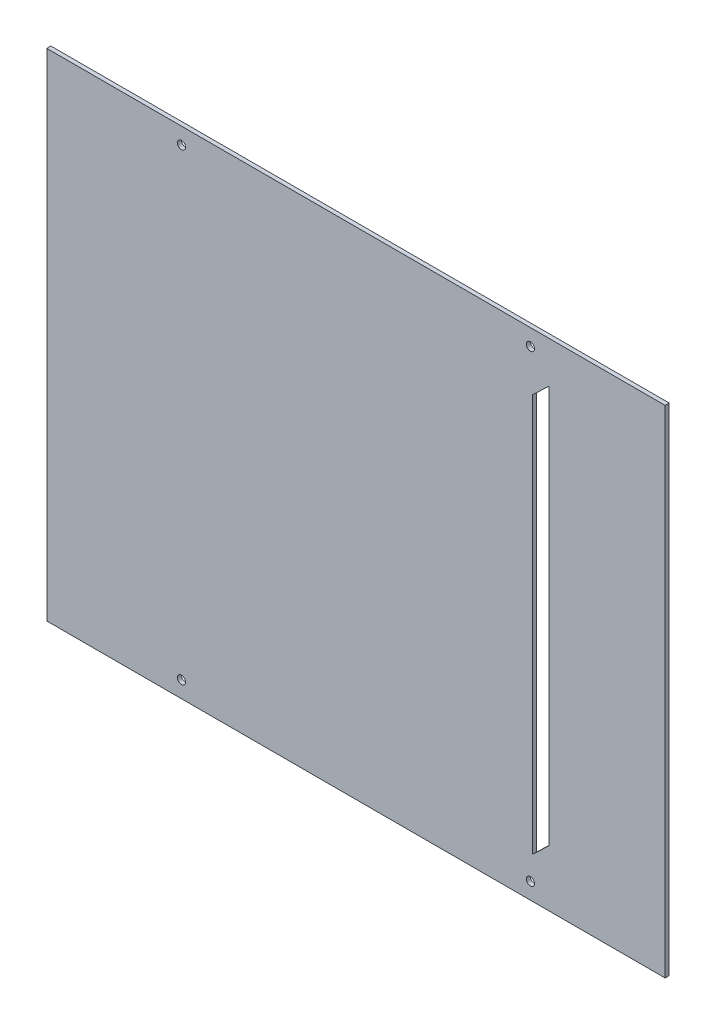
ISO-10303-21;
HEADER;
FILE_DESCRIPTION(('STEP AP214'),'2;1');
FILE_NAME('part.step','',(''),(''),'','','');
FILE_SCHEMA(('AUTOMOTIVE_DESIGN { 1 0 10303 214 1 1 1 1 }'));
ENDSEC;
DATA;
#1=APPLICATION_CONTEXT('core data for automotive mechanical design processes');
#2=APPLICATION_PROTOCOL_DEFINITION('international standard','automotive_design',2000,#1);
#3=PRODUCT_CONTEXT('',#1,'mechanical');
#4=PRODUCT('Part','Part','',(#3));
#5=PRODUCT_RELATED_PRODUCT_CATEGORY('part','',(#4));
#6=PRODUCT_DEFINITION_FORMATION('','',#4);
#7=PRODUCT_DEFINITION_CONTEXT('part definition',#1,'design');
#8=PRODUCT_DEFINITION('design','',#6,#7);
#9=PRODUCT_DEFINITION_SHAPE('','',#8);
#10=(LENGTH_UNIT() NAMED_UNIT(*) SI_UNIT(.MILLI.,.METRE.));
#11=(NAMED_UNIT(*) PLANE_ANGLE_UNIT() SI_UNIT($,.RADIAN.));
#12=(NAMED_UNIT(*) SI_UNIT($,.STERADIAN.) SOLID_ANGLE_UNIT());
#13=UNCERTAINTY_MEASURE_WITH_UNIT(LENGTH_MEASURE(1.E-05),#10,'distance_accuracy_value','');
#14=(GEOMETRIC_REPRESENTATION_CONTEXT(3) GLOBAL_UNCERTAINTY_ASSIGNED_CONTEXT((#13)) GLOBAL_UNIT_ASSIGNED_CONTEXT((#10,
#11,#12)) REPRESENTATION_CONTEXT('',''));
#15=CARTESIAN_POINT('',(0.,0.,0.));
#16=DIRECTION('',(0.,0.,1.));
#17=DIRECTION('',(1.,0.,0.));
#18=AXIS2_PLACEMENT_3D('',#15,#16,#17);
#19=CARTESIAN_POINT('',(91.5845103929161,-96.6836489414578,2.));
#20=DIRECTION('',(0.68770299476145,-0.725992142516799,0.));
#21=DIRECTION('',(0.725992142516799,0.68770299476145,0.));
#22=AXIS2_PLACEMENT_3D('',#19,#20,#21);
#23=PLANE('',#22);
#24=DIRECTION('',(-0.725992142516799,-0.68770299476145,0.));
#25=VECTOR('',#24,1.);
#26=CARTESIAN_POINT('',(91.5845103929161,-96.6836489414578,0.));
#27=LINE('',#26,#25);
#28=CARTESIAN_POINT('',(94.5,-93.92192355,0.));
#29=VERTEX_POINT('',#28);
#30=CARTESIAN_POINT('',(86.5,-101.5,0.));
#31=VERTEX_POINT('',#30);
#32=EDGE_CURVE('E155',#29,#31,#27,.T.);
#33=ORIENTED_EDGE('',*,*,#32,.T.);
#34=DIRECTION('',(0.,0.,-1.));
#35=VECTOR('',#34,1.);
#36=CARTESIAN_POINT('',(86.5,-101.5,2.));
#37=LINE('',#36,#35);
#38=CARTESIAN_POINT('',(86.5,-101.5,2.));
#39=VERTEX_POINT('',#38);
#40=EDGE_CURVE('E11',#39,#31,#37,.T.);
#41=ORIENTED_EDGE('',*,*,#40,.F.);
#42=DIRECTION('',(-0.725992142516799,-0.68770299476145,0.));
#43=VECTOR('',#42,1.);
#44=CARTESIAN_POINT('',(91.5845103929161,-96.6836489414578,2.));
#45=LINE('',#44,#43);
#46=CARTESIAN_POINT('',(94.5,-93.92192355,2.));
#47=VERTEX_POINT('',#46);
#48=EDGE_CURVE('E117',#47,#39,#45,.T.);
#49=ORIENTED_EDGE('',*,*,#48,.F.);
#50=DIRECTION('',(0.,0.,-1.));
#51=VECTOR('',#50,1.);
#52=CARTESIAN_POINT('',(94.5,-93.92192355,2.));
#53=LINE('',#52,#51);
#54=EDGE_CURVE('E165',#47,#29,#53,.T.);
#55=ORIENTED_EDGE('',*,*,#54,.T.);
#56=EDGE_LOOP('',(#33,#41,#49,#55));
#57=FACE_BOUND('',#56,.T.);
#58=ADVANCED_FACE('F35',(#57),#23,.F.);
#59=CARTESIAN_POINT('',(86.5,0.,2.));
#60=DIRECTION('',(-1.,0.,0.));
#61=DIRECTION('',(0.,0.,1.));
#62=AXIS2_PLACEMENT_3D('',#59,#60,#61);
#63=PLANE('',#62);
#64=DIRECTION('',(0.,1.,0.));
#65=VECTOR('',#64,1.);
#66=CARTESIAN_POINT('',(86.5,0.,0.));
#67=LINE('',#66,#65);
#68=CARTESIAN_POINT('',(86.5,93.5,0.));
#69=VERTEX_POINT('',#68);
#70=EDGE_CURVE('E122',#31,#69,#67,.T.);
#71=ORIENTED_EDGE('',*,*,#70,.T.);
#72=DIRECTION('',(0.,0.,-1.));
#73=VECTOR('',#72,1.);
#74=CARTESIAN_POINT('',(86.5,93.5,2.));
#75=LINE('',#74,#73);
#76=CARTESIAN_POINT('',(86.5,93.5,2.));
#77=VERTEX_POINT('',#76);
#78=EDGE_CURVE('E45',#77,#69,#75,.T.);
#79=ORIENTED_EDGE('',*,*,#78,.F.);
#80=DIRECTION('',(0.,1.,0.));
#81=VECTOR('',#80,1.);
#82=CARTESIAN_POINT('',(86.5,0.,2.));
#83=LINE('',#82,#81);
#84=EDGE_CURVE('E110',#39,#77,#83,.T.);
#85=ORIENTED_EDGE('',*,*,#84,.F.);
#86=ORIENTED_EDGE('',*,*,#40,.T.);
#87=EDGE_LOOP('',(#71,#79,#85,#86));
#88=FACE_BOUND('',#87,.T.);
#89=ADVANCED_FACE('F121',(#88),#63,.F.);
#90=CARTESIAN_POINT('',(-5.77254887059046,6.09394630278818,2.));
#91=DIRECTION('',(-0.68770299476145,0.7259921425168,0.));
#92=DIRECTION('',(-0.7259921425168,-0.68770299476145,0.));
#93=AXIS2_PLACEMENT_3D('',#90,#91,#92);
#94=PLANE('',#93);
#95=DIRECTION('',(0.7259921425168,0.68770299476145,0.));
#96=VECTOR('',#95,1.);
#97=CARTESIAN_POINT('',(-5.77254887059046,6.09394630278818,0.));
#98=LINE('',#97,#96);
#99=CARTESIAN_POINT('',(94.5,101.07807645,0.));
#100=VERTEX_POINT('',#99);
#101=EDGE_CURVE('E83',#69,#100,#98,.T.);
#102=ORIENTED_EDGE('',*,*,#101,.T.);
#103=DIRECTION('',(0.,0.,-1.));
#104=VECTOR('',#103,1.);
#105=CARTESIAN_POINT('',(94.5,101.07807645,2.));
#106=LINE('',#105,#104);
#107=CARTESIAN_POINT('',(94.5,101.07807645,2.));
#108=VERTEX_POINT('',#107);
#109=EDGE_CURVE('E123',#108,#100,#106,.T.);
#110=ORIENTED_EDGE('',*,*,#109,.F.);
#111=DIRECTION('',(0.7259921425168,0.68770299476145,0.));
#112=VECTOR('',#111,1.);
#113=CARTESIAN_POINT('',(-5.77254887059046,6.09394630278818,2.));
#114=LINE('',#113,#112);
#115=EDGE_CURVE('E115',#77,#108,#114,.T.);
#116=ORIENTED_EDGE('',*,*,#115,.F.);
#117=ORIENTED_EDGE('',*,*,#78,.T.);
#118=EDGE_LOOP('',(#102,#110,#116,#117));
#119=FACE_BOUND('',#118,.T.);
#120=ADVANCED_FACE('F125',(#119),#94,.F.);
#121=CARTESIAN_POINT('',(-151.5,0.,2.));
#122=DIRECTION('',(-1.,0.,0.));
#123=DIRECTION('',(0.,0.,1.));
#124=AXIS2_PLACEMENT_3D('',#121,#122,#123);
#125=PLANE('',#124);
#126=DIRECTION('',(0.,1.,0.));
#127=VECTOR('',#126,1.);
#128=CARTESIAN_POINT('',(-151.5,0.,0.));
#129=LINE('',#128,#127);
#130=CARTESIAN_POINT('',(-151.5,-121.5,0.));
#131=VERTEX_POINT('',#130);
#132=CARTESIAN_POINT('',(-151.5,121.5,0.));
#133=VERTEX_POINT('',#132);
#134=EDGE_CURVE('E143',#131,#133,#129,.T.);
#135=ORIENTED_EDGE('',*,*,#134,.F.);
#136=DIRECTION('',(0.,0.,-1.));
#137=VECTOR('',#136,1.);
#138=CARTESIAN_POINT('',(-151.5,-121.5,2.));
#139=LINE('',#138,#137);
#140=CARTESIAN_POINT('',(-151.5,-121.5,2.));
#141=VERTEX_POINT('',#140);
#142=EDGE_CURVE('E39',#141,#131,#139,.T.);
#143=ORIENTED_EDGE('',*,*,#142,.F.);
#144=DIRECTION('',(0.,1.,0.));
#145=VECTOR('',#144,1.);
#146=CARTESIAN_POINT('',(-151.5,0.,2.));
#147=LINE('',#146,#145);
#148=CARTESIAN_POINT('',(-151.5,121.5,2.));
#149=VERTEX_POINT('',#148);
#150=EDGE_CURVE('E196',#141,#149,#147,.T.);
#151=ORIENTED_EDGE('',*,*,#150,.T.);
#152=DIRECTION('',(0.,0.,-1.));
#153=VECTOR('',#152,1.);
#154=CARTESIAN_POINT('',(-151.5,121.5,2.));
#155=LINE('',#154,#153);
#156=EDGE_CURVE('E133',#149,#133,#155,.T.);
#157=ORIENTED_EDGE('',*,*,#156,.T.);
#158=EDGE_LOOP('',(#135,#143,#151,#157));
#159=FACE_BOUND('',#158,.T.);
#160=ADVANCED_FACE('F181',(#159),#125,.T.);
#161=CARTESIAN_POINT('',(0.,-121.5,2.));
#162=DIRECTION('',(0.,-1.,0.));
#163=DIRECTION('',(1.,0.,0.));
#164=AXIS2_PLACEMENT_3D('',#161,#162,#163);
#165=PLANE('',#164);
#166=DIRECTION('',(-1.,0.,0.));
#167=VECTOR('',#166,1.);
#168=CARTESIAN_POINT('',(0.,-121.5,0.));
#169=LINE('',#168,#167);
#170=CARTESIAN_POINT('',(151.5,-121.5,0.));
#171=VERTEX_POINT('',#170);
#172=EDGE_CURVE('E146',#171,#131,#169,.T.);
#173=ORIENTED_EDGE('',*,*,#172,.F.);
#174=DIRECTION('',(0.,0.,-1.));
#175=VECTOR('',#174,1.);
#176=CARTESIAN_POINT('',(151.5,-121.5,2.));
#177=LINE('',#176,#175);
#178=CARTESIAN_POINT('',(151.5,-121.5,2.));
#179=VERTEX_POINT('',#178);
#180=EDGE_CURVE('E171',#179,#171,#177,.T.);
#181=ORIENTED_EDGE('',*,*,#180,.F.);
#182=DIRECTION('',(-1.,0.,0.));
#183=VECTOR('',#182,1.);
#184=CARTESIAN_POINT('',(0.,-121.5,2.));
#185=LINE('',#184,#183);
#186=EDGE_CURVE('E180',#179,#141,#185,.T.);
#187=ORIENTED_EDGE('',*,*,#186,.T.);
#188=ORIENTED_EDGE('',*,*,#142,.T.);
#189=EDGE_LOOP('',(#173,#181,#187,#188));
#190=FACE_BOUND('',#189,.T.);
#191=ADVANCED_FACE('F178',(#190),#165,.T.);
#192=CARTESIAN_POINT('',(151.5,0.,2.));
#193=DIRECTION('',(-1.,0.,0.));
#194=DIRECTION('',(0.,0.,1.));
#195=AXIS2_PLACEMENT_3D('',#192,#193,#194);
#196=PLANE('',#195);
#197=DIRECTION('',(0.,1.,0.));
#198=VECTOR('',#197,1.);
#199=CARTESIAN_POINT('',(151.5,0.,0.));
#200=LINE('',#199,#198);
#201=CARTESIAN_POINT('',(151.5,121.5,0.));
#202=VERTEX_POINT('',#201);
#203=EDGE_CURVE('E149',#171,#202,#200,.T.);
#204=ORIENTED_EDGE('',*,*,#203,.T.);
#205=DIRECTION('',(0.,0.,-1.));
#206=VECTOR('',#205,1.);
#207=CARTESIAN_POINT('',(151.5,121.5,2.));
#208=LINE('',#207,#206);
#209=CARTESIAN_POINT('',(151.5,121.5,2.));
#210=VERTEX_POINT('',#209);
#211=EDGE_CURVE('E169',#210,#202,#208,.T.);
#212=ORIENTED_EDGE('',*,*,#211,.F.);
#213=DIRECTION('',(0.,1.,0.));
#214=VECTOR('',#213,1.);
#215=CARTESIAN_POINT('',(151.5,0.,2.));
#216=LINE('',#215,#214);
#217=EDGE_CURVE('E189',#179,#210,#216,.T.);
#218=ORIENTED_EDGE('',*,*,#217,.F.);
#219=ORIENTED_EDGE('',*,*,#180,.T.);
#220=EDGE_LOOP('',(#204,#212,#218,#219));
#221=FACE_BOUND('',#220,.T.);
#222=ADVANCED_FACE('F187',(#221),#196,.F.);
#223=CARTESIAN_POINT('',(94.5,0.,2.));
#224=DIRECTION('',(1.,0.,0.));
#225=DIRECTION('',(0.,0.,-1.));
#226=AXIS2_PLACEMENT_3D('',#223,#224,#225);
#227=PLANE('',#226);
#228=DIRECTION('',(0.,-1.,0.));
#229=VECTOR('',#228,1.);
#230=CARTESIAN_POINT('',(94.5,0.,0.));
#231=LINE('',#230,#229);
#232=EDGE_CURVE('E89',#100,#29,#231,.T.);
#233=ORIENTED_EDGE('',*,*,#232,.T.);
#234=ORIENTED_EDGE('',*,*,#54,.F.);
#235=DIRECTION('',(0.,-1.,0.));
#236=VECTOR('',#235,1.);
#237=CARTESIAN_POINT('',(94.5,0.,2.));
#238=LINE('',#237,#236);
#239=EDGE_CURVE('E54',#108,#47,#238,.T.);
#240=ORIENTED_EDGE('',*,*,#239,.F.);
#241=ORIENTED_EDGE('',*,*,#109,.T.);
#242=EDGE_LOOP('',(#233,#234,#240,#241));
#243=FACE_BOUND('',#242,.T.);
#244=ADVANCED_FACE('F233',(#243),#227,.F.);
#245=CARTESIAN_POINT('',(0.,121.5,2.));
#246=DIRECTION('',(0.,-1.,0.));
#247=DIRECTION('',(0.,0.,-1.));
#248=AXIS2_PLACEMENT_3D('',#245,#246,#247);
#249=PLANE('',#248);
#250=DIRECTION('',(-1.,0.,0.));
#251=VECTOR('',#250,1.);
#252=CARTESIAN_POINT('',(0.,121.5,0.));
#253=LINE('',#252,#251);
#254=EDGE_CURVE('E152',#202,#133,#253,.T.);
#255=ORIENTED_EDGE('',*,*,#254,.T.);
#256=ORIENTED_EDGE('',*,*,#156,.F.);
#257=DIRECTION('',(-1.,0.,0.));
#258=VECTOR('',#257,1.);
#259=CARTESIAN_POINT('',(0.,121.5,2.));
#260=LINE('',#259,#258);
#261=EDGE_CURVE('E192',#210,#149,#260,.T.);
#262=ORIENTED_EDGE('',*,*,#261,.F.);
#263=ORIENTED_EDGE('',*,*,#211,.T.);
#264=EDGE_LOOP('',(#255,#256,#262,#263));
#265=FACE_BOUND('',#264,.T.);
#266=ADVANCED_FACE('F191',(#265),#249,.F.);
#267=CARTESIAN_POINT('',(-85.5,113.480198019802,2.));
#268=DIRECTION('',(0.,0.,-1.));
#269=DIRECTION('',(-1.,0.,0.));
#270=AXIS2_PLACEMENT_3D('',#267,#268,#269);
#271=CYLINDRICAL_SURFACE('',#270,2.00000000000001);
#272=CARTESIAN_POINT('',(-85.5,113.480198019802,2.));
#273=DIRECTION('',(0.,0.,1.));
#274=DIRECTION('',(1.,0.,0.));
#275=AXIS2_PLACEMENT_3D('',#272,#273,#274);
#276=CIRCLE('',#275,2.00000000000001);
#277=CARTESIAN_POINT('',(-83.5,113.480198019802,2.));
#278=VERTEX_POINT('',#277);
#279=EDGE_CURVE('E200',#278,#278,#276,.T.);
#280=ORIENTED_EDGE('',*,*,#279,.T.);
#281=EDGE_LOOP('',(#280));
#282=FACE_BOUND('',#281,.T.);
#283=CARTESIAN_POINT('',(-85.5,113.480198019802,0.));
#284=DIRECTION('',(0.,0.,1.));
#285=DIRECTION('',(1.,0.,0.));
#286=AXIS2_PLACEMENT_3D('',#283,#284,#285);
#287=CIRCLE('',#286,2.00000000000001);
#288=CARTESIAN_POINT('',(-83.5,113.480198019802,0.));
#289=VERTEX_POINT('',#288);
#290=EDGE_CURVE('E140',#289,#289,#287,.T.);
#291=ORIENTED_EDGE('',*,*,#290,.F.);
#292=EDGE_LOOP('',(#291));
#293=FACE_BOUND('',#292,.T.);
#294=ADVANCED_FACE('F224',(#282,#293),#271,.F.);
#295=CARTESIAN_POINT('',(85.5,113.480198019802,2.));
#296=DIRECTION('',(0.,0.,-1.));
#297=DIRECTION('',(-1.,0.,0.));
#298=AXIS2_PLACEMENT_3D('',#295,#296,#297);
#299=CYLINDRICAL_SURFACE('',#298,2.00000000000001);
#300=CARTESIAN_POINT('',(85.5,113.480198019802,2.));
#301=DIRECTION('',(0.,0.,1.));
#302=DIRECTION('',(1.,0.,0.));
#303=AXIS2_PLACEMENT_3D('',#300,#301,#302);
#304=CIRCLE('',#303,2.00000000000001);
#305=CARTESIAN_POINT('',(87.5,113.480198019802,2.));
#306=VERTEX_POINT('',#305);
#307=EDGE_CURVE('E203',#306,#306,#304,.T.);
#308=ORIENTED_EDGE('',*,*,#307,.T.);
#309=EDGE_LOOP('',(#308));
#310=FACE_BOUND('',#309,.T.);
#311=CARTESIAN_POINT('',(85.5,113.480198019802,0.));
#312=DIRECTION('',(0.,0.,1.));
#313=DIRECTION('',(1.,0.,0.));
#314=AXIS2_PLACEMENT_3D('',#311,#312,#313);
#315=CIRCLE('',#314,2.00000000000001);
#316=CARTESIAN_POINT('',(87.5,113.480198019802,0.));
#317=VERTEX_POINT('',#316);
#318=EDGE_CURVE('E137',#317,#317,#315,.T.);
#319=ORIENTED_EDGE('',*,*,#318,.F.);
#320=EDGE_LOOP('',(#319));
#321=FACE_BOUND('',#320,.T.);
#322=ADVANCED_FACE('F214',(#310,#321),#299,.F.);
#323=CARTESIAN_POINT('',(85.4999999999999,-113.480198019802,2.));
#324=DIRECTION('',(0.,0.,-1.));
#325=DIRECTION('',(-1.,0.,0.));
#326=AXIS2_PLACEMENT_3D('',#323,#324,#325);
#327=CYLINDRICAL_SURFACE('',#326,2.00000000000001);
#328=CARTESIAN_POINT('',(85.4999999999999,-113.480198019802,2.));
#329=DIRECTION('',(0.,0.,1.));
#330=DIRECTION('',(1.,0.,0.));
#331=AXIS2_PLACEMENT_3D('',#328,#329,#330);
#332=CIRCLE('',#331,2.00000000000001);
#333=CARTESIAN_POINT('',(87.5,-113.480198019802,2.));
#334=VERTEX_POINT('',#333);
#335=EDGE_CURVE('E164',#334,#334,#332,.F.);
#336=ORIENTED_EDGE('',*,*,#335,.F.);
#337=EDGE_LOOP('',(#336));
#338=FACE_BOUND('',#337,.T.);
#339=CARTESIAN_POINT('',(85.4999999999999,-113.480198019802,0.));
#340=DIRECTION('',(0.,0.,1.));
#341=DIRECTION('',(1.,0.,0.));
#342=AXIS2_PLACEMENT_3D('',#339,#340,#341);
#343=CIRCLE('',#342,2.00000000000001);
#344=CARTESIAN_POINT('',(87.5,-113.480198019802,0.));
#345=VERTEX_POINT('',#344);
#346=EDGE_CURVE('E134',#345,#345,#343,.F.);
#347=ORIENTED_EDGE('',*,*,#346,.T.);
#348=EDGE_LOOP('',(#347));
#349=FACE_BOUND('',#348,.T.);
#350=ADVANCED_FACE('F37',(#338,#349),#327,.F.);
#351=CARTESIAN_POINT('',(-85.5,-113.480198019802,2.));
#352=DIRECTION('',(0.,0.,-1.));
#353=DIRECTION('',(-1.,0.,0.));
#354=AXIS2_PLACEMENT_3D('',#351,#352,#353);
#355=CYLINDRICAL_SURFACE('',#354,2.00000000000001);
#356=CARTESIAN_POINT('',(-85.5,-113.480198019802,2.));
#357=DIRECTION('',(0.,0.,1.));
#358=DIRECTION('',(1.,0.,0.));
#359=AXIS2_PLACEMENT_3D('',#356,#357,#358);
#360=CIRCLE('',#359,2.00000000000001);
#361=CARTESIAN_POINT('',(-83.5,-113.480198019802,2.));
#362=VERTEX_POINT('',#361);
#363=EDGE_CURVE('E127',#362,#362,#360,.F.);
#364=ORIENTED_EDGE('',*,*,#363,.F.);
#365=EDGE_LOOP('',(#364));
#366=FACE_BOUND('',#365,.T.);
#367=CARTESIAN_POINT('',(-85.5,-113.480198019802,0.));
#368=DIRECTION('',(0.,0.,1.));
#369=DIRECTION('',(1.,0.,0.));
#370=AXIS2_PLACEMENT_3D('',#367,#368,#369);
#371=CIRCLE('',#370,2.00000000000001);
#372=CARTESIAN_POINT('',(-83.5,-113.480198019802,0.));
#373=VERTEX_POINT('',#372);
#374=EDGE_CURVE('E161',#373,#373,#371,.F.);
#375=ORIENTED_EDGE('',*,*,#374,.T.);
#376=EDGE_LOOP('',(#375));
#377=FACE_BOUND('',#376,.T.);
#378=ADVANCED_FACE('F213',(#366,#377),#355,.F.);
#379=CARTESIAN_POINT('',(0.,0.,2.));
#380=DIRECTION('',(0.,0.,1.));
#381=DIRECTION('',(1.,0.,0.));
#382=AXIS2_PLACEMENT_3D('',#379,#380,#381);
#383=PLANE('',#382);
#384=ORIENTED_EDGE('',*,*,#335,.T.);
#385=EDGE_LOOP('',(#384));
#386=FACE_BOUND('',#385,.T.);
#387=ORIENTED_EDGE('',*,*,#307,.F.);
#388=EDGE_LOOP('',(#387));
#389=FACE_BOUND('',#388,.T.);
#390=ORIENTED_EDGE('',*,*,#279,.F.);
#391=EDGE_LOOP('',(#390));
#392=FACE_BOUND('',#391,.T.);
#393=ORIENTED_EDGE('',*,*,#150,.F.);
#394=ORIENTED_EDGE('',*,*,#186,.F.);
#395=ORIENTED_EDGE('',*,*,#217,.T.);
#396=ORIENTED_EDGE('',*,*,#261,.T.);
#397=EDGE_LOOP('',(#393,#394,#395,#396));
#398=FACE_BOUND('',#397,.T.);
#399=ORIENTED_EDGE('',*,*,#48,.T.);
#400=ORIENTED_EDGE('',*,*,#84,.T.);
#401=ORIENTED_EDGE('',*,*,#115,.T.);
#402=ORIENTED_EDGE('',*,*,#239,.T.);
#403=EDGE_LOOP('',(#399,#400,#401,#402));
#404=FACE_BOUND('',#403,.T.);
#405=ORIENTED_EDGE('',*,*,#363,.T.);
#406=EDGE_LOOP('',(#405));
#407=FACE_BOUND('',#406,.T.);
#408=ADVANCED_FACE('F112',(#386,#389,#392,#398,#404,#407),#383,.T.);
#409=CARTESIAN_POINT('',(0.,0.,0.));
#410=DIRECTION('',(0.,0.,1.));
#411=DIRECTION('',(1.,0.,0.));
#412=AXIS2_PLACEMENT_3D('',#409,#410,#411);
#413=PLANE('',#412);
#414=ORIENTED_EDGE('',*,*,#346,.F.);
#415=EDGE_LOOP('',(#414));
#416=FACE_BOUND('',#415,.T.);
#417=ORIENTED_EDGE('',*,*,#318,.T.);
#418=EDGE_LOOP('',(#417));
#419=FACE_BOUND('',#418,.T.);
#420=ORIENTED_EDGE('',*,*,#290,.T.);
#421=EDGE_LOOP('',(#420));
#422=FACE_BOUND('',#421,.T.);
#423=ORIENTED_EDGE('',*,*,#134,.T.);
#424=ORIENTED_EDGE('',*,*,#254,.F.);
#425=ORIENTED_EDGE('',*,*,#203,.F.);
#426=ORIENTED_EDGE('',*,*,#172,.T.);
#427=EDGE_LOOP('',(#423,#424,#425,#426));
#428=FACE_BOUND('',#427,.T.);
#429=ORIENTED_EDGE('',*,*,#32,.F.);
#430=ORIENTED_EDGE('',*,*,#232,.F.);
#431=ORIENTED_EDGE('',*,*,#101,.F.);
#432=ORIENTED_EDGE('',*,*,#70,.F.);
#433=EDGE_LOOP('',(#429,#430,#431,#432));
#434=FACE_BOUND('',#433,.T.);
#435=ORIENTED_EDGE('',*,*,#374,.F.);
#436=EDGE_LOOP('',(#435));
#437=FACE_BOUND('',#436,.T.);
#438=ADVANCED_FACE('F184',(#416,#419,#422,#428,#434,#437),#413,.F.);
#439=CLOSED_SHELL('',(#58,#89,#120,#160,#191,#222,#244,#266,#294,#322,#350,#378,#408,#438));
#440=MANIFOLD_SOLID_BREP('B2',#439);
#441=ADVANCED_BREP_SHAPE_REPRESENTATION('',(#18,#440),#14);
#442=SHAPE_DEFINITION_REPRESENTATION(#9,#441);
ENDSEC;
END-ISO-10303-21;
